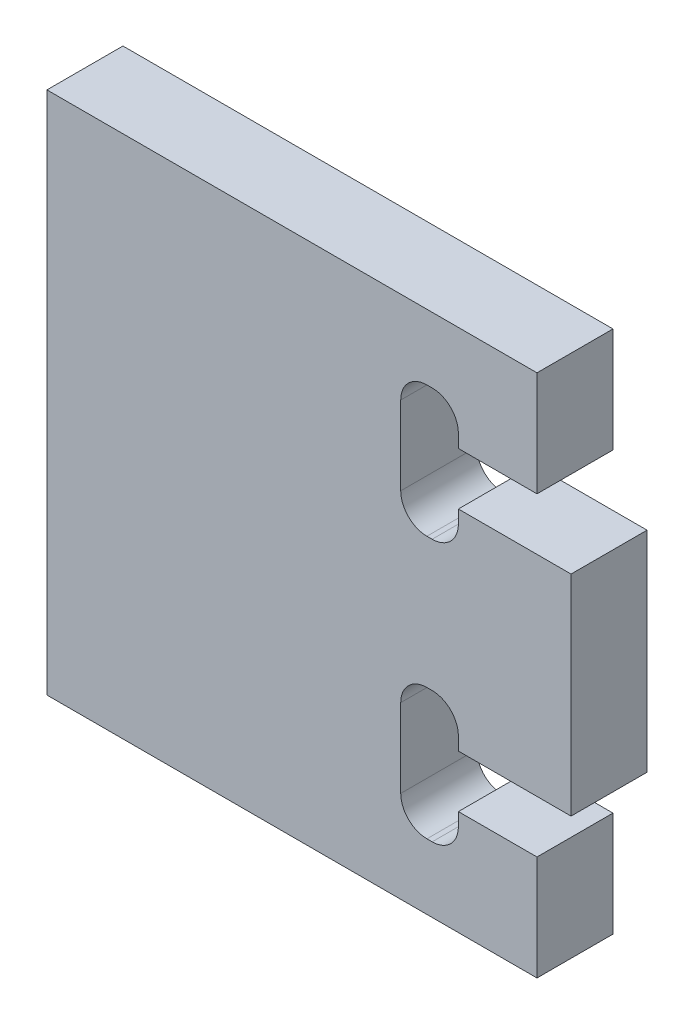
ISO-10303-21;
HEADER;
FILE_DESCRIPTION(('STEP AP214'),'2;1');
FILE_NAME('part.step','',(''),(''),'','','');
FILE_SCHEMA(('AUTOMOTIVE_DESIGN { 1 0 10303 214 1 1 1 1 }'));
ENDSEC;
DATA;
#1=APPLICATION_CONTEXT('core data for automotive mechanical design processes');
#2=APPLICATION_PROTOCOL_DEFINITION('international standard','automotive_design',2000,#1);
#3=PRODUCT_CONTEXT('',#1,'mechanical');
#4=PRODUCT('Part','Part','',(#3));
#5=PRODUCT_RELATED_PRODUCT_CATEGORY('part','',(#4));
#6=PRODUCT_DEFINITION_FORMATION('','',#4);
#7=PRODUCT_DEFINITION_CONTEXT('part definition',#1,'design');
#8=PRODUCT_DEFINITION('design','',#6,#7);
#9=PRODUCT_DEFINITION_SHAPE('','',#8);
#10=(LENGTH_UNIT() NAMED_UNIT(*) SI_UNIT(.MILLI.,.METRE.));
#11=(NAMED_UNIT(*) PLANE_ANGLE_UNIT() SI_UNIT($,.RADIAN.));
#12=(NAMED_UNIT(*) SI_UNIT($,.STERADIAN.) SOLID_ANGLE_UNIT());
#13=UNCERTAINTY_MEASURE_WITH_UNIT(LENGTH_MEASURE(1.E-05),#10,'distance_accuracy_value','');
#14=(GEOMETRIC_REPRESENTATION_CONTEXT(3) GLOBAL_UNCERTAINTY_ASSIGNED_CONTEXT((#13)) GLOBAL_UNIT_ASSIGNED_CONTEXT((#10,
#11,#12)) REPRESENTATION_CONTEXT('',''));
#15=CARTESIAN_POINT('',(0.,0.,0.));
#16=DIRECTION('',(0.,0.,1.));
#17=DIRECTION('',(1.,0.,0.));
#18=AXIS2_PLACEMENT_3D('',#15,#16,#17);
#19=CARTESIAN_POINT('',(36.5,0.,2.9));
#20=DIRECTION('',(-1.,0.,0.));
#21=DIRECTION('',(0.,-1.,0.));
#22=AXIS2_PLACEMENT_3D('',#19,#20,#21);
#23=PLANE('',#22);
#24=DIRECTION('',(0.,1.,0.));
#25=VECTOR('',#24,1.);
#26=CARTESIAN_POINT('',(36.5,0.,2.9));
#27=LINE('',#26,#25);
#28=CARTESIAN_POINT('',(36.5,-3.99999999999999,2.9));
#29=VERTEX_POINT('',#28);
#30=CARTESIAN_POINT('',(36.5,-3.5,2.9));
#31=VERTEX_POINT('',#30);
#32=EDGE_CURVE('E264',#29,#31,#27,.T.);
#33=ORIENTED_EDGE('',*,*,#32,.T.);
#34=DIRECTION('',(0.,0.,-1.));
#35=VECTOR('',#34,1.);
#36=CARTESIAN_POINT('',(36.5,-3.5,2.9));
#37=LINE('',#36,#35);
#38=CARTESIAN_POINT('',(36.5,-3.5,0.));
#39=VERTEX_POINT('',#38);
#40=EDGE_CURVE('E314',#31,#39,#37,.T.);
#41=ORIENTED_EDGE('',*,*,#40,.T.);
#42=DIRECTION('',(0.,1.,0.));
#43=VECTOR('',#42,1.);
#44=CARTESIAN_POINT('',(36.5,0.,0.));
#45=LINE('',#44,#43);
#46=CARTESIAN_POINT('',(36.5,-3.99999999999999,0.));
#47=VERTEX_POINT('',#46);
#48=EDGE_CURVE('E238',#47,#39,#45,.T.);
#49=ORIENTED_EDGE('',*,*,#48,.F.);
#50=DIRECTION('',(0.,0.,-1.));
#51=VECTOR('',#50,1.);
#52=CARTESIAN_POINT('',(36.5,-3.99999999999999,2.9));
#53=LINE('',#52,#51);
#54=EDGE_CURVE('E288',#29,#47,#53,.T.);
#55=ORIENTED_EDGE('',*,*,#54,.F.);
#56=EDGE_LOOP('',(#33,#41,#49,#55));
#57=FACE_BOUND('',#56,.T.);
#58=ADVANCED_FACE('F38',(#57),#23,.T.);
#59=CARTESIAN_POINT('',(0.,-4.,2.9));
#60=DIRECTION('',(0.,1.,0.));
#61=DIRECTION('',(-1.,0.,0.));
#62=AXIS2_PLACEMENT_3D('',#59,#60,#61);
#63=PLANE('',#62);
#64=DIRECTION('',(1.,0.,0.));
#65=VECTOR('',#64,1.);
#66=CARTESIAN_POINT('',(0.,-4.,0.));
#67=LINE('',#66,#65);
#68=CARTESIAN_POINT('',(40.8,-3.99999999999999,0.));
#69=VERTEX_POINT('',#68);
#70=EDGE_CURVE('E409',#47,#69,#67,.T.);
#71=ORIENTED_EDGE('',*,*,#70,.T.);
#72=DIRECTION('',(0.,0.,-1.));
#73=VECTOR('',#72,1.);
#74=CARTESIAN_POINT('',(40.8,-3.99999999999999,2.9));
#75=LINE('',#74,#73);
#76=CARTESIAN_POINT('',(40.8,-3.99999999999999,2.9));
#77=VERTEX_POINT('',#76);
#78=EDGE_CURVE('E285',#77,#69,#75,.T.);
#79=ORIENTED_EDGE('',*,*,#78,.F.);
#80=DIRECTION('',(1.,0.,0.));
#81=VECTOR('',#80,1.);
#82=CARTESIAN_POINT('',(0.,-4.,2.9));
#83=LINE('',#82,#81);
#84=EDGE_CURVE('E453',#29,#77,#83,.T.);
#85=ORIENTED_EDGE('',*,*,#84,.F.);
#86=ORIENTED_EDGE('',*,*,#54,.T.);
#87=EDGE_LOOP('',(#71,#79,#85,#86));
#88=FACE_BOUND('',#87,.T.);
#89=ADVANCED_FACE('F490',(#88),#63,.F.);
#90=CARTESIAN_POINT('',(40.8,0.,2.9));
#91=DIRECTION('',(-1.,0.,0.));
#92=DIRECTION('',(0.,0.,1.));
#93=AXIS2_PLACEMENT_3D('',#90,#91,#92);
#94=PLANE('',#93);
#95=DIRECTION('',(0.,1.,0.));
#96=VECTOR('',#95,1.);
#97=CARTESIAN_POINT('',(40.8,0.,0.));
#98=LINE('',#97,#96);
#99=CARTESIAN_POINT('',(40.8,3.99999999999999,0.));
#100=VERTEX_POINT('',#99);
#101=EDGE_CURVE('E411',#69,#100,#98,.T.);
#102=ORIENTED_EDGE('',*,*,#101,.T.);
#103=DIRECTION('',(0.,0.,-1.));
#104=VECTOR('',#103,1.);
#105=CARTESIAN_POINT('',(40.8,3.99999999999999,2.9));
#106=LINE('',#105,#104);
#107=CARTESIAN_POINT('',(40.8,3.99999999999999,2.9));
#108=VERTEX_POINT('',#107);
#109=EDGE_CURVE('E283',#108,#100,#106,.T.);
#110=ORIENTED_EDGE('',*,*,#109,.F.);
#111=DIRECTION('',(0.,1.,0.));
#112=VECTOR('',#111,1.);
#113=CARTESIAN_POINT('',(40.8,0.,2.9));
#114=LINE('',#113,#112);
#115=EDGE_CURVE('E455',#77,#108,#114,.T.);
#116=ORIENTED_EDGE('',*,*,#115,.F.);
#117=ORIENTED_EDGE('',*,*,#78,.T.);
#118=EDGE_LOOP('',(#102,#110,#116,#117));
#119=FACE_BOUND('',#118,.T.);
#120=ADVANCED_FACE('F485',(#119),#94,.F.);
#121=CARTESIAN_POINT('',(0.,4.,2.9));
#122=DIRECTION('',(0.,1.,0.));
#123=DIRECTION('',(-1.,0.,0.));
#124=AXIS2_PLACEMENT_3D('',#121,#122,#123);
#125=PLANE('',#124);
#126=DIRECTION('',(1.,0.,0.));
#127=VECTOR('',#126,1.);
#128=CARTESIAN_POINT('',(0.,4.,0.));
#129=LINE('',#128,#127);
#130=CARTESIAN_POINT('',(36.5,3.99999999999999,0.));
#131=VERTEX_POINT('',#130);
#132=EDGE_CURVE('E414',#131,#100,#129,.T.);
#133=ORIENTED_EDGE('',*,*,#132,.F.);
#134=DIRECTION('',(0.,0.,-1.));
#135=VECTOR('',#134,1.);
#136=CARTESIAN_POINT('',(36.5,3.99999999999999,2.9));
#137=LINE('',#136,#135);
#138=CARTESIAN_POINT('',(36.5,3.99999999999999,2.9));
#139=VERTEX_POINT('',#138);
#140=EDGE_CURVE('E281',#139,#131,#137,.T.);
#141=ORIENTED_EDGE('',*,*,#140,.F.);
#142=DIRECTION('',(1.,0.,0.));
#143=VECTOR('',#142,1.);
#144=CARTESIAN_POINT('',(0.,4.,2.9));
#145=LINE('',#144,#143);
#146=EDGE_CURVE('E457',#139,#108,#145,.T.);
#147=ORIENTED_EDGE('',*,*,#146,.T.);
#148=ORIENTED_EDGE('',*,*,#109,.T.);
#149=EDGE_LOOP('',(#133,#141,#147,#148));
#150=FACE_BOUND('',#149,.T.);
#151=ADVANCED_FACE('F479',(#150),#125,.T.);
#152=CARTESIAN_POINT('',(36.5,0.,2.9));
#153=DIRECTION('',(1.,0.,0.));
#154=DIRECTION('',(0.,1.,0.));
#155=AXIS2_PLACEMENT_3D('',#152,#153,#154);
#156=PLANE('',#155);
#157=DIRECTION('',(0.,-1.,0.));
#158=VECTOR('',#157,1.);
#159=CARTESIAN_POINT('',(36.5,0.,0.));
#160=LINE('',#159,#158);
#161=CARTESIAN_POINT('',(36.5,3.5,0.));
#162=VERTEX_POINT('',#161);
#163=EDGE_CURVE('E417',#131,#162,#160,.T.);
#164=ORIENTED_EDGE('',*,*,#163,.T.);
#165=DIRECTION('',(0.,0.,-1.));
#166=VECTOR('',#165,1.);
#167=CARTESIAN_POINT('',(36.5,3.5,2.9));
#168=LINE('',#167,#166);
#169=CARTESIAN_POINT('',(36.5,3.5,2.9));
#170=VERTEX_POINT('',#169);
#171=EDGE_CURVE('E302',#162,#170,#168,.F.);
#172=ORIENTED_EDGE('',*,*,#171,.T.);
#173=DIRECTION('',(0.,-1.,0.));
#174=VECTOR('',#173,1.);
#175=CARTESIAN_POINT('',(36.5,0.,2.9));
#176=LINE('',#175,#174);
#177=EDGE_CURVE('E382',#139,#170,#176,.T.);
#178=ORIENTED_EDGE('',*,*,#177,.F.);
#179=ORIENTED_EDGE('',*,*,#140,.T.);
#180=EDGE_LOOP('',(#164,#172,#178,#179));
#181=FACE_BOUND('',#180,.T.);
#182=ADVANCED_FACE('F475',(#181),#156,.F.);
#183=CARTESIAN_POINT('',(0.,2.50000000000001,2.9));
#184=DIRECTION('',(0.,1.,0.));
#185=DIRECTION('',(-1.,0.,0.));
#186=AXIS2_PLACEMENT_3D('',#183,#184,#185);
#187=PLANE('',#186);
#188=DIRECTION('',(1.,0.,0.));
#189=VECTOR('',#188,1.);
#190=CARTESIAN_POINT('',(0.,2.50000000000001,2.9));
#191=LINE('',#190,#189);
#192=CARTESIAN_POINT('',(35.3,2.5,2.9));
#193=VERTEX_POINT('',#192);
#194=CARTESIAN_POINT('',(35.5,2.5,2.9));
#195=VERTEX_POINT('',#194);
#196=EDGE_CURVE('E383',#193,#195,#191,.T.);
#197=ORIENTED_EDGE('',*,*,#196,.T.);
#198=DIRECTION('',(0.,0.,-1.));
#199=VECTOR('',#198,1.);
#200=CARTESIAN_POINT('',(35.5,2.5,2.9));
#201=LINE('',#200,#199);
#202=CARTESIAN_POINT('',(35.5,2.5,0.));
#203=VERTEX_POINT('',#202);
#204=EDGE_CURVE('E299',#195,#203,#201,.T.);
#205=ORIENTED_EDGE('',*,*,#204,.T.);
#206=DIRECTION('',(1.,0.,0.));
#207=VECTOR('',#206,1.);
#208=CARTESIAN_POINT('',(0.,2.50000000000001,0.));
#209=LINE('',#208,#207);
#210=CARTESIAN_POINT('',(35.3,2.5,0.));
#211=VERTEX_POINT('',#210);
#212=EDGE_CURVE('E369',#211,#203,#209,.T.);
#213=ORIENTED_EDGE('',*,*,#212,.F.);
#214=DIRECTION('',(0.,0.,-1.));
#215=VECTOR('',#214,1.);
#216=CARTESIAN_POINT('',(35.3,2.5,2.9));
#217=LINE('',#216,#215);
#218=EDGE_CURVE('E297',#211,#193,#217,.F.);
#219=ORIENTED_EDGE('',*,*,#218,.T.);
#220=EDGE_LOOP('',(#197,#205,#213,#219));
#221=FACE_BOUND('',#220,.T.);
#222=ADVANCED_FACE('F464',(#221),#187,.T.);
#223=CARTESIAN_POINT('',(34.3,0.,2.9));
#224=DIRECTION('',(1.,0.,0.));
#225=DIRECTION('',(0.,1.,0.));
#226=AXIS2_PLACEMENT_3D('',#223,#224,#225);
#227=PLANE('',#226);
#228=DIRECTION('',(0.,-1.,0.));
#229=VECTOR('',#228,1.);
#230=CARTESIAN_POINT('',(34.3,0.,2.9));
#231=LINE('',#230,#229);
#232=CARTESIAN_POINT('',(34.3,6.5,2.9));
#233=VERTEX_POINT('',#232);
#234=CARTESIAN_POINT('',(34.3,3.5,2.9));
#235=VERTEX_POINT('',#234);
#236=EDGE_CURVE('E376',#233,#235,#231,.T.);
#237=ORIENTED_EDGE('',*,*,#236,.T.);
#238=DIRECTION('',(0.,0.,-1.));
#239=VECTOR('',#238,1.);
#240=CARTESIAN_POINT('',(34.3,3.5,0.));
#241=LINE('',#240,#239);
#242=CARTESIAN_POINT('',(34.3,3.5,0.));
#243=VERTEX_POINT('',#242);
#244=EDGE_CURVE('E306',#235,#243,#241,.T.);
#245=ORIENTED_EDGE('',*,*,#244,.T.);
#246=DIRECTION('',(0.,-1.,0.));
#247=VECTOR('',#246,1.);
#248=CARTESIAN_POINT('',(34.3,0.,0.));
#249=LINE('',#248,#247);
#250=CARTESIAN_POINT('',(34.3,6.5,0.));
#251=VERTEX_POINT('',#250);
#252=EDGE_CURVE('E359',#251,#243,#249,.T.);
#253=ORIENTED_EDGE('',*,*,#252,.F.);
#254=DIRECTION('',(0.,0.,-1.));
#255=VECTOR('',#254,1.);
#256=CARTESIAN_POINT('',(34.3,6.5,2.9));
#257=LINE('',#256,#255);
#258=EDGE_CURVE('E304',#251,#233,#257,.F.);
#259=ORIENTED_EDGE('',*,*,#258,.T.);
#260=EDGE_LOOP('',(#237,#245,#253,#259));
#261=FACE_BOUND('',#260,.T.);
#262=ADVANCED_FACE('F366',(#261),#227,.T.);
#263=CARTESIAN_POINT('',(0.,7.5,2.9));
#264=DIRECTION('',(0.,1.,0.));
#265=DIRECTION('',(0.,0.,1.));
#266=AXIS2_PLACEMENT_3D('',#263,#264,#265);
#267=PLANE('',#266);
#268=DIRECTION('',(1.,0.,0.));
#269=VECTOR('',#268,1.);
#270=CARTESIAN_POINT('',(0.,7.5,0.));
#271=LINE('',#270,#269);
#272=CARTESIAN_POINT('',(35.3,7.5,0.));
#273=VERTEX_POINT('',#272);
#274=CARTESIAN_POINT('',(35.5,7.5,0.));
#275=VERTEX_POINT('',#274);
#276=EDGE_CURVE('E360',#273,#275,#271,.T.);
#277=ORIENTED_EDGE('',*,*,#276,.T.);
#278=DIRECTION('',(0.,0.,-1.));
#279=VECTOR('',#278,1.);
#280=CARTESIAN_POINT('',(35.5,7.5,2.9));
#281=LINE('',#280,#279);
#282=CARTESIAN_POINT('',(35.5,7.5,2.9));
#283=VERTEX_POINT('',#282);
#284=EDGE_CURVE('E61',#275,#283,#281,.F.);
#285=ORIENTED_EDGE('',*,*,#284,.T.);
#286=DIRECTION('',(1.,0.,0.));
#287=VECTOR('',#286,1.);
#288=CARTESIAN_POINT('',(0.,7.5,2.9));
#289=LINE('',#288,#287);
#290=CARTESIAN_POINT('',(35.3,7.5,2.9));
#291=VERTEX_POINT('',#290);
#292=EDGE_CURVE('E374',#291,#283,#289,.T.);
#293=ORIENTED_EDGE('',*,*,#292,.F.);
#294=DIRECTION('',(0.,0.,-1.));
#295=VECTOR('',#294,1.);
#296=CARTESIAN_POINT('',(35.3,7.5,2.9));
#297=LINE('',#296,#295);
#298=EDGE_CURVE('E325',#291,#273,#297,.T.);
#299=ORIENTED_EDGE('',*,*,#298,.T.);
#300=EDGE_LOOP('',(#277,#285,#293,#299));
#301=FACE_BOUND('',#300,.T.);
#302=ADVANCED_FACE('F377',(#301),#267,.F.);
#303=CARTESIAN_POINT('',(36.5,6.5,2.9));
#304=VERTEX_POINT('',#303);
#305=CARTESIAN_POINT('',(36.5,5.99999999999999,2.9));
#306=VERTEX_POINT('',#305);
#307=EDGE_CURVE('E378',#304,#306,#176,.T.);
#308=ORIENTED_EDGE('',*,*,#307,.F.);
#309=DIRECTION('',(0.,0.,-1.));
#310=VECTOR('',#309,1.);
#311=CARTESIAN_POINT('',(36.5,6.5,0.));
#312=LINE('',#311,#310);
#313=CARTESIAN_POINT('',(36.5,6.5,0.));
#314=VERTEX_POINT('',#313);
#315=EDGE_CURVE('E322',#304,#314,#312,.T.);
#316=ORIENTED_EDGE('',*,*,#315,.T.);
#317=CARTESIAN_POINT('',(36.5,5.99999999999999,0.));
#318=VERTEX_POINT('',#317);
#319=EDGE_CURVE('E420',#314,#318,#160,.T.);
#320=ORIENTED_EDGE('',*,*,#319,.T.);
#321=DIRECTION('',(0.,0.,-1.));
#322=VECTOR('',#321,1.);
#323=CARTESIAN_POINT('',(36.5,5.99999999999999,2.9));
#324=LINE('',#323,#322);
#325=EDGE_CURVE('E278',#306,#318,#324,.T.);
#326=ORIENTED_EDGE('',*,*,#325,.F.);
#327=EDGE_LOOP('',(#308,#316,#320,#326));
#328=FACE_BOUND('',#327,.T.);
#329=ADVANCED_FACE('F441',(#328),#156,.F.);
#330=CARTESIAN_POINT('',(0.,6.,2.9));
#331=DIRECTION('',(0.,1.,0.));
#332=DIRECTION('',(-1.,0.,0.));
#333=AXIS2_PLACEMENT_3D('',#330,#331,#332);
#334=PLANE('',#333);
#335=DIRECTION('',(1.,0.,0.));
#336=VECTOR('',#335,1.);
#337=CARTESIAN_POINT('',(0.,6.,0.));
#338=LINE('',#337,#336);
#339=CARTESIAN_POINT('',(39.5,5.99999999999999,0.));
#340=VERTEX_POINT('',#339);
#341=EDGE_CURVE('E424',#318,#340,#338,.T.);
#342=ORIENTED_EDGE('',*,*,#341,.T.);
#343=DIRECTION('',(0.,0.,-1.));
#344=VECTOR('',#343,1.);
#345=CARTESIAN_POINT('',(39.5,5.99999999999999,2.9));
#346=LINE('',#345,#344);
#347=CARTESIAN_POINT('',(39.5,5.99999999999999,2.9));
#348=VERTEX_POINT('',#347);
#349=EDGE_CURVE('E276',#348,#340,#346,.T.);
#350=ORIENTED_EDGE('',*,*,#349,.F.);
#351=DIRECTION('',(1.,0.,0.));
#352=VECTOR('',#351,1.);
#353=CARTESIAN_POINT('',(0.,6.,2.9));
#354=LINE('',#353,#352);
#355=EDGE_CURVE('E380',#306,#348,#354,.T.);
#356=ORIENTED_EDGE('',*,*,#355,.F.);
#357=ORIENTED_EDGE('',*,*,#325,.T.);
#358=EDGE_LOOP('',(#342,#350,#356,#357));
#359=FACE_BOUND('',#358,.T.);
#360=ADVANCED_FACE('F437',(#359),#334,.F.);
#361=CARTESIAN_POINT('',(39.5,0.,2.9));
#362=DIRECTION('',(1.,0.,0.));
#363=DIRECTION('',(0.,0.,-1.));
#364=AXIS2_PLACEMENT_3D('',#361,#362,#363);
#365=PLANE('',#364);
#366=DIRECTION('',(0.,-1.,0.));
#367=VECTOR('',#366,1.);
#368=CARTESIAN_POINT('',(39.5,0.,0.));
#369=LINE('',#368,#367);
#370=CARTESIAN_POINT('',(39.5,10.,0.));
#371=VERTEX_POINT('',#370);
#372=EDGE_CURVE('E249',#371,#340,#369,.T.);
#373=ORIENTED_EDGE('',*,*,#372,.F.);
#374=DIRECTION('',(0.,0.,-1.));
#375=VECTOR('',#374,1.);
#376=CARTESIAN_POINT('',(39.5,10.,2.9));
#377=LINE('',#376,#375);
#378=CARTESIAN_POINT('',(39.5,10.,2.9));
#379=VERTEX_POINT('',#378);
#380=EDGE_CURVE('E273',#379,#371,#377,.T.);
#381=ORIENTED_EDGE('',*,*,#380,.F.);
#382=DIRECTION('',(0.,-1.,0.));
#383=VECTOR('',#382,1.);
#384=CARTESIAN_POINT('',(39.5,0.,2.9));
#385=LINE('',#384,#383);
#386=EDGE_CURVE('E388',#379,#348,#385,.T.);
#387=ORIENTED_EDGE('',*,*,#386,.T.);
#388=ORIENTED_EDGE('',*,*,#349,.T.);
#389=EDGE_LOOP('',(#373,#381,#387,#388));
#390=FACE_BOUND('',#389,.T.);
#391=ADVANCED_FACE('F432',(#390),#365,.T.);
#392=CARTESIAN_POINT('',(0.,10.,2.9));
#393=DIRECTION('',(0.,1.,0.));
#394=DIRECTION('',(0.,0.,1.));
#395=AXIS2_PLACEMENT_3D('',#392,#393,#394);
#396=PLANE('',#395);
#397=DIRECTION('',(0.,0.,1.));
#398=VECTOR('',#397,1.);
#399=CARTESIAN_POINT('',(20.8,10.,-0.00100000000000013));
#400=LINE('',#399,#398);
#401=CARTESIAN_POINT('',(20.8,10.,0.));
#402=VERTEX_POINT('',#401);
#403=CARTESIAN_POINT('',(20.8,10.,2.9));
#404=VERTEX_POINT('',#403);
#405=EDGE_CURVE('E53',#402,#404,#400,.T.);
#406=ORIENTED_EDGE('',*,*,#405,.T.);
#407=DIRECTION('',(1.,0.,0.));
#408=VECTOR('',#407,1.);
#409=CARTESIAN_POINT('',(0.,10.,2.9));
#410=LINE('',#409,#408);
#411=EDGE_CURVE('E391',#404,#379,#410,.T.);
#412=ORIENTED_EDGE('',*,*,#411,.T.);
#413=ORIENTED_EDGE('',*,*,#380,.T.);
#414=DIRECTION('',(1.,0.,0.));
#415=VECTOR('',#414,1.);
#416=CARTESIAN_POINT('',(0.,10.,0.));
#417=LINE('',#416,#415);
#418=EDGE_CURVE('E245',#402,#371,#417,.T.);
#419=ORIENTED_EDGE('',*,*,#418,.F.);
#420=EDGE_LOOP('',(#406,#412,#413,#419));
#421=FACE_BOUND('',#420,.T.);
#422=ADVANCED_FACE('F447',(#421),#396,.T.);
#423=CARTESIAN_POINT('',(0.,-10.,2.9));
#424=DIRECTION('',(0.,1.,0.));
#425=DIRECTION('',(0.,0.,1.));
#426=AXIS2_PLACEMENT_3D('',#423,#424,#425);
#427=PLANE('',#426);
#428=DIRECTION('',(1.,0.,0.));
#429=VECTOR('',#428,1.);
#430=CARTESIAN_POINT('',(0.,-10.,2.9));
#431=LINE('',#430,#429);
#432=CARTESIAN_POINT('',(20.8,-10.,2.9));
#433=VERTEX_POINT('',#432);
#434=CARTESIAN_POINT('',(39.5,-10.,2.9));
#435=VERTEX_POINT('',#434);
#436=EDGE_CURVE('E237',#433,#435,#431,.T.);
#437=ORIENTED_EDGE('',*,*,#436,.F.);
#438=DIRECTION('',(0.,0.,1.));
#439=VECTOR('',#438,1.);
#440=CARTESIAN_POINT('',(20.8,-10.,-0.00100000000000013));
#441=LINE('',#440,#439);
#442=CARTESIAN_POINT('',(20.8,-10.,0.));
#443=VERTEX_POINT('',#442);
#444=EDGE_CURVE('E224',#443,#433,#441,.T.);
#445=ORIENTED_EDGE('',*,*,#444,.F.);
#446=DIRECTION('',(1.,0.,0.));
#447=VECTOR('',#446,1.);
#448=CARTESIAN_POINT('',(0.,-10.,0.));
#449=LINE('',#448,#447);
#450=CARTESIAN_POINT('',(39.5,-10.,0.));
#451=VERTEX_POINT('',#450);
#452=EDGE_CURVE('E235',#443,#451,#449,.T.);
#453=ORIENTED_EDGE('',*,*,#452,.T.);
#454=DIRECTION('',(0.,0.,-1.));
#455=VECTOR('',#454,1.);
#456=CARTESIAN_POINT('',(39.5,-10.,2.9));
#457=LINE('',#456,#455);
#458=EDGE_CURVE('E271',#435,#451,#457,.T.);
#459=ORIENTED_EDGE('',*,*,#458,.F.);
#460=EDGE_LOOP('',(#437,#445,#453,#459));
#461=FACE_BOUND('',#460,.T.);
#462=ADVANCED_FACE('F233',(#461),#427,.F.);
#463=CARTESIAN_POINT('',(39.5,-5.99999999999999,0.));
#464=VERTEX_POINT('',#463);
#465=EDGE_CURVE('E244',#464,#451,#369,.T.);
#466=ORIENTED_EDGE('',*,*,#465,.F.);
#467=DIRECTION('',(0.,0.,-1.));
#468=VECTOR('',#467,1.);
#469=CARTESIAN_POINT('',(39.5,-5.99999999999999,2.9));
#470=LINE('',#469,#468);
#471=CARTESIAN_POINT('',(39.5,-5.99999999999999,2.9));
#472=VERTEX_POINT('',#471);
#473=EDGE_CURVE('E268',#472,#464,#470,.T.);
#474=ORIENTED_EDGE('',*,*,#473,.F.);
#475=EDGE_CURVE('E392',#472,#435,#385,.T.);
#476=ORIENTED_EDGE('',*,*,#475,.T.);
#477=ORIENTED_EDGE('',*,*,#458,.T.);
#478=EDGE_LOOP('',(#466,#474,#476,#477));
#479=FACE_BOUND('',#478,.T.);
#480=ADVANCED_FACE('F537',(#479),#365,.T.);
#481=CARTESIAN_POINT('',(0.,-6.,2.9));
#482=DIRECTION('',(0.,1.,0.));
#483=DIRECTION('',(-1.,0.,0.));
#484=AXIS2_PLACEMENT_3D('',#481,#482,#483);
#485=PLANE('',#484);
#486=DIRECTION('',(1.,0.,0.));
#487=VECTOR('',#486,1.);
#488=CARTESIAN_POINT('',(0.,-6.,0.));
#489=LINE('',#488,#487);
#490=CARTESIAN_POINT('',(36.5,-5.99999999999999,0.));
#491=VERTEX_POINT('',#490);
#492=EDGE_CURVE('E247',#491,#464,#489,.T.);
#493=ORIENTED_EDGE('',*,*,#492,.F.);
#494=DIRECTION('',(0.,0.,-1.));
#495=VECTOR('',#494,1.);
#496=CARTESIAN_POINT('',(36.5,-5.99999999999999,2.9));
#497=LINE('',#496,#495);
#498=CARTESIAN_POINT('',(36.5,-5.99999999999999,2.9));
#499=VERTEX_POINT('',#498);
#500=EDGE_CURVE('E265',#499,#491,#497,.T.);
#501=ORIENTED_EDGE('',*,*,#500,.F.);
#502=DIRECTION('',(1.,0.,0.));
#503=VECTOR('',#502,1.);
#504=CARTESIAN_POINT('',(0.,-6.,2.9));
#505=LINE('',#504,#503);
#506=EDGE_CURVE('E395',#499,#472,#505,.T.);
#507=ORIENTED_EDGE('',*,*,#506,.T.);
#508=ORIENTED_EDGE('',*,*,#473,.T.);
#509=EDGE_LOOP('',(#493,#501,#507,#508));
#510=FACE_BOUND('',#509,.T.);
#511=ADVANCED_FACE('F533',(#510),#485,.T.);
#512=CARTESIAN_POINT('',(36.5,-6.5,0.));
#513=VERTEX_POINT('',#512);
#514=EDGE_CURVE('E254',#513,#491,#45,.T.);
#515=ORIENTED_EDGE('',*,*,#514,.F.);
#516=DIRECTION('',(0.,0.,-1.));
#517=VECTOR('',#516,1.);
#518=CARTESIAN_POINT('',(36.5,-6.5,2.9));
#519=LINE('',#518,#517);
#520=CARTESIAN_POINT('',(36.5,-6.5,2.9));
#521=VERTEX_POINT('',#520);
#522=EDGE_CURVE('E295',#513,#521,#519,.F.);
#523=ORIENTED_EDGE('',*,*,#522,.T.);
#524=EDGE_CURVE('E398',#521,#499,#27,.T.);
#525=ORIENTED_EDGE('',*,*,#524,.T.);
#526=ORIENTED_EDGE('',*,*,#500,.T.);
#527=EDGE_LOOP('',(#515,#523,#525,#526));
#528=FACE_BOUND('',#527,.T.);
#529=ADVANCED_FACE('F527',(#528),#23,.T.);
#530=CARTESIAN_POINT('',(0.,-7.5,2.9));
#531=DIRECTION('',(0.,1.,0.));
#532=DIRECTION('',(0.,0.,1.));
#533=AXIS2_PLACEMENT_3D('',#530,#531,#532);
#534=PLANE('',#533);
#535=DIRECTION('',(1.,0.,0.));
#536=VECTOR('',#535,1.);
#537=CARTESIAN_POINT('',(0.,-7.5,2.9));
#538=LINE('',#537,#536);
#539=CARTESIAN_POINT('',(35.3,-7.5,2.9));
#540=VERTEX_POINT('',#539);
#541=CARTESIAN_POINT('',(35.5,-7.5,2.9));
#542=VERTEX_POINT('',#541);
#543=EDGE_CURVE('E399',#540,#542,#538,.T.);
#544=ORIENTED_EDGE('',*,*,#543,.T.);
#545=DIRECTION('',(0.,0.,-1.));
#546=VECTOR('',#545,1.);
#547=CARTESIAN_POINT('',(35.5,-7.5,0.));
#548=LINE('',#547,#546);
#549=CARTESIAN_POINT('',(35.5,-7.5,0.));
#550=VERTEX_POINT('',#549);
#551=EDGE_CURVE('E292',#542,#550,#548,.T.);
#552=ORIENTED_EDGE('',*,*,#551,.T.);
#553=DIRECTION('',(1.,0.,0.));
#554=VECTOR('',#553,1.);
#555=CARTESIAN_POINT('',(0.,-7.5,0.));
#556=LINE('',#555,#554);
#557=CARTESIAN_POINT('',(35.3,-7.5,0.));
#558=VERTEX_POINT('',#557);
#559=EDGE_CURVE('E255',#558,#550,#556,.T.);
#560=ORIENTED_EDGE('',*,*,#559,.F.);
#561=DIRECTION('',(0.,0.,-1.));
#562=VECTOR('',#561,1.);
#563=CARTESIAN_POINT('',(35.3,-7.5,2.9));
#564=LINE('',#563,#562);
#565=EDGE_CURVE('E290',#558,#540,#564,.F.);
#566=ORIENTED_EDGE('',*,*,#565,.T.);
#567=EDGE_LOOP('',(#544,#552,#560,#566));
#568=FACE_BOUND('',#567,.T.);
#569=ADVANCED_FACE('F518',(#568),#534,.T.);
#570=CARTESIAN_POINT('',(34.3,0.,2.9));
#571=DIRECTION('',(-1.,0.,0.));
#572=DIRECTION('',(0.,-1.,0.));
#573=AXIS2_PLACEMENT_3D('',#570,#571,#572);
#574=PLANE('',#573);
#575=DIRECTION('',(0.,1.,0.));
#576=VECTOR('',#575,1.);
#577=CARTESIAN_POINT('',(34.3,0.,2.9));
#578=LINE('',#577,#576);
#579=CARTESIAN_POINT('',(34.3,-6.5,2.9));
#580=VERTEX_POINT('',#579);
#581=CARTESIAN_POINT('',(34.3,-3.5,2.9));
#582=VERTEX_POINT('',#581);
#583=EDGE_CURVE('E402',#580,#582,#578,.T.);
#584=ORIENTED_EDGE('',*,*,#583,.F.);
#585=DIRECTION('',(0.,0.,-1.));
#586=VECTOR('',#585,1.);
#587=CARTESIAN_POINT('',(34.3,-6.5,2.9));
#588=LINE('',#587,#586);
#589=CARTESIAN_POINT('',(34.3,-6.5,0.));
#590=VERTEX_POINT('',#589);
#591=EDGE_CURVE('E311',#580,#590,#588,.T.);
#592=ORIENTED_EDGE('',*,*,#591,.T.);
#593=DIRECTION('',(0.,1.,0.));
#594=VECTOR('',#593,1.);
#595=CARTESIAN_POINT('',(34.3,0.,0.));
#596=LINE('',#595,#594);
#597=CARTESIAN_POINT('',(34.3,-3.5,0.));
#598=VERTEX_POINT('',#597);
#599=EDGE_CURVE('E258',#590,#598,#596,.T.);
#600=ORIENTED_EDGE('',*,*,#599,.T.);
#601=DIRECTION('',(0.,0.,-1.));
#602=VECTOR('',#601,1.);
#603=CARTESIAN_POINT('',(34.3,-3.5,2.9));
#604=LINE('',#603,#602);
#605=EDGE_CURVE('E309',#598,#582,#604,.F.);
#606=ORIENTED_EDGE('',*,*,#605,.T.);
#607=EDGE_LOOP('',(#584,#592,#600,#606));
#608=FACE_BOUND('',#607,.T.);
#609=ADVANCED_FACE('F510',(#608),#574,.F.);
#610=CARTESIAN_POINT('',(0.,-2.50000000000001,2.9));
#611=DIRECTION('',(0.,1.,0.));
#612=DIRECTION('',(-1.,0.,0.));
#613=AXIS2_PLACEMENT_3D('',#610,#611,#612);
#614=PLANE('',#613);
#615=DIRECTION('',(1.,0.,0.));
#616=VECTOR('',#615,1.);
#617=CARTESIAN_POINT('',(0.,-2.50000000000001,0.));
#618=LINE('',#617,#616);
#619=CARTESIAN_POINT('',(35.3,-2.5,0.));
#620=VERTEX_POINT('',#619);
#621=CARTESIAN_POINT('',(35.5,-2.5,0.));
#622=VERTEX_POINT('',#621);
#623=EDGE_CURVE('E261',#620,#622,#618,.T.);
#624=ORIENTED_EDGE('',*,*,#623,.T.);
#625=DIRECTION('',(0.,0.,-1.));
#626=VECTOR('',#625,1.);
#627=CARTESIAN_POINT('',(35.5,-2.5,2.9));
#628=LINE('',#627,#626);
#629=CARTESIAN_POINT('',(35.5,-2.5,2.9));
#630=VERTEX_POINT('',#629);
#631=EDGE_CURVE('E320',#622,#630,#628,.F.);
#632=ORIENTED_EDGE('',*,*,#631,.T.);
#633=DIRECTION('',(1.,0.,0.));
#634=VECTOR('',#633,1.);
#635=CARTESIAN_POINT('',(0.,-2.50000000000001,2.9));
#636=LINE('',#635,#634);
#637=CARTESIAN_POINT('',(35.3,-2.5,2.9));
#638=VERTEX_POINT('',#637);
#639=EDGE_CURVE('E269',#638,#630,#636,.T.);
#640=ORIENTED_EDGE('',*,*,#639,.F.);
#641=DIRECTION('',(0.,0.,-1.));
#642=VECTOR('',#641,1.);
#643=CARTESIAN_POINT('',(35.3,-2.5,0.));
#644=LINE('',#643,#642);
#645=EDGE_CURVE('E317',#638,#620,#644,.T.);
#646=ORIENTED_EDGE('',*,*,#645,.T.);
#647=EDGE_LOOP('',(#624,#632,#640,#646));
#648=FACE_BOUND('',#647,.T.);
#649=ADVANCED_FACE('F498',(#648),#614,.F.);
#650=CARTESIAN_POINT('',(0.,0.,2.9));
#651=DIRECTION('',(0.,0.,1.));
#652=DIRECTION('',(1.,0.,0.));
#653=AXIS2_PLACEMENT_3D('',#650,#651,#652);
#654=PLANE('',#653);
#655=DIRECTION('',(0.,1.,0.));
#656=VECTOR('',#655,1.);
#657=CARTESIAN_POINT('',(20.8,10.,2.9));
#658=LINE('',#657,#656);
#659=EDGE_CURVE('E229',#433,#404,#658,.T.);
#660=ORIENTED_EDGE('',*,*,#659,.F.);
#661=ORIENTED_EDGE('',*,*,#436,.T.);
#662=ORIENTED_EDGE('',*,*,#475,.F.);
#663=ORIENTED_EDGE('',*,*,#506,.F.);
#664=ORIENTED_EDGE('',*,*,#524,.F.);
#665=CARTESIAN_POINT('',(35.5,-6.5,2.9));
#666=DIRECTION('',(0.,0.,1.));
#667=DIRECTION('',(1.,0.,0.));
#668=AXIS2_PLACEMENT_3D('',#665,#666,#667);
#669=CIRCLE('',#668,1.);
#670=EDGE_CURVE('E331',#521,#542,#669,.F.);
#671=ORIENTED_EDGE('',*,*,#670,.T.);
#672=ORIENTED_EDGE('',*,*,#543,.F.);
#673=CARTESIAN_POINT('',(35.3,-6.5,2.9));
#674=DIRECTION('',(0.,0.,1.));
#675=DIRECTION('',(1.,0.,0.));
#676=AXIS2_PLACEMENT_3D('',#673,#674,#675);
#677=CIRCLE('',#676,1.);
#678=EDGE_CURVE('E343',#540,#580,#677,.F.);
#679=ORIENTED_EDGE('',*,*,#678,.T.);
#680=ORIENTED_EDGE('',*,*,#583,.T.);
#681=CARTESIAN_POINT('',(35.3,-3.5,2.9));
#682=DIRECTION('',(0.,0.,1.));
#683=DIRECTION('',(1.,0.,0.));
#684=AXIS2_PLACEMENT_3D('',#681,#682,#683);
#685=CIRCLE('',#684,1.);
#686=EDGE_CURVE('E355',#582,#638,#685,.F.);
#687=ORIENTED_EDGE('',*,*,#686,.T.);
#688=ORIENTED_EDGE('',*,*,#639,.T.);
#689=CARTESIAN_POINT('',(35.5,-3.5,2.9));
#690=DIRECTION('',(0.,0.,1.));
#691=DIRECTION('',(1.,0.,0.));
#692=AXIS2_PLACEMENT_3D('',#689,#690,#691);
#693=CIRCLE('',#692,1.);
#694=EDGE_CURVE('E347',#630,#31,#693,.F.);
#695=ORIENTED_EDGE('',*,*,#694,.T.);
#696=ORIENTED_EDGE('',*,*,#32,.F.);
#697=ORIENTED_EDGE('',*,*,#84,.T.);
#698=ORIENTED_EDGE('',*,*,#115,.T.);
#699=ORIENTED_EDGE('',*,*,#146,.F.);
#700=ORIENTED_EDGE('',*,*,#177,.T.);
#701=CARTESIAN_POINT('',(35.5,3.5,2.9));
#702=DIRECTION('',(0.,0.,1.));
#703=DIRECTION('',(1.,0.,0.));
#704=AXIS2_PLACEMENT_3D('',#701,#702,#703);
#705=CIRCLE('',#704,1.);
#706=EDGE_CURVE('E335',#170,#195,#705,.F.);
#707=ORIENTED_EDGE('',*,*,#706,.T.);
#708=ORIENTED_EDGE('',*,*,#196,.F.);
#709=CARTESIAN_POINT('',(35.3,3.5,2.9));
#710=DIRECTION('',(0.,0.,1.));
#711=DIRECTION('',(1.,0.,0.));
#712=AXIS2_PLACEMENT_3D('',#709,#710,#711);
#713=CIRCLE('',#712,1.);
#714=EDGE_CURVE('E339',#193,#235,#713,.F.);
#715=ORIENTED_EDGE('',*,*,#714,.T.);
#716=ORIENTED_EDGE('',*,*,#236,.F.);
#717=CARTESIAN_POINT('',(35.3,6.5,2.9));
#718=DIRECTION('',(0.,0.,1.));
#719=DIRECTION('',(1.,0.,0.));
#720=AXIS2_PLACEMENT_3D('',#717,#718,#719);
#721=CIRCLE('',#720,1.);
#722=EDGE_CURVE('E11',#233,#291,#721,.F.);
#723=ORIENTED_EDGE('',*,*,#722,.T.);
#724=ORIENTED_EDGE('',*,*,#292,.T.);
#725=CARTESIAN_POINT('',(35.5,6.5,2.9));
#726=DIRECTION('',(0.,0.,1.));
#727=DIRECTION('',(1.,0.,0.));
#728=AXIS2_PLACEMENT_3D('',#725,#726,#727);
#729=CIRCLE('',#728,1.);
#730=EDGE_CURVE('E351',#283,#304,#729,.F.);
#731=ORIENTED_EDGE('',*,*,#730,.T.);
#732=ORIENTED_EDGE('',*,*,#307,.T.);
#733=ORIENTED_EDGE('',*,*,#355,.T.);
#734=ORIENTED_EDGE('',*,*,#386,.F.);
#735=ORIENTED_EDGE('',*,*,#411,.F.);
#736=EDGE_LOOP('',(#660,#661,#662,#663,#664,#671,#672,#679,#680,#687,#688,#695,#696,#697,#698,
#699,#700,#707,#708,#715,#716,#723,#724,#731,#732,#733,#734,#735));
#737=FACE_BOUND('',#736,.T.);
#738=ADVANCED_FACE('F373',(#737),#654,.T.);
#739=CARTESIAN_POINT('',(0.,0.,0.));
#740=DIRECTION('',(0.,0.,1.));
#741=DIRECTION('',(1.,0.,0.));
#742=AXIS2_PLACEMENT_3D('',#739,#740,#741);
#743=PLANE('',#742);
#744=ORIENTED_EDGE('',*,*,#452,.F.);
#745=DIRECTION('',(0.,-1.,0.));
#746=VECTOR('',#745,1.);
#747=CARTESIAN_POINT('',(20.8,10.,0.));
#748=LINE('',#747,#746);
#749=EDGE_CURVE('E221',#402,#443,#748,.T.);
#750=ORIENTED_EDGE('',*,*,#749,.F.);
#751=ORIENTED_EDGE('',*,*,#418,.T.);
#752=ORIENTED_EDGE('',*,*,#372,.T.);
#753=ORIENTED_EDGE('',*,*,#341,.F.);
#754=ORIENTED_EDGE('',*,*,#319,.F.);
#755=CARTESIAN_POINT('',(35.5,6.5,0.));
#756=DIRECTION('',(0.,0.,1.));
#757=DIRECTION('',(1.,0.,0.));
#758=AXIS2_PLACEMENT_3D('',#755,#756,#757);
#759=CIRCLE('',#758,1.);
#760=EDGE_CURVE('E349',#314,#275,#759,.T.);
#761=ORIENTED_EDGE('',*,*,#760,.T.);
#762=ORIENTED_EDGE('',*,*,#276,.F.);
#763=CARTESIAN_POINT('',(35.3,6.5,0.));
#764=DIRECTION('',(0.,0.,1.));
#765=DIRECTION('',(1.,0.,0.));
#766=AXIS2_PLACEMENT_3D('',#763,#764,#765);
#767=CIRCLE('',#766,1.);
#768=EDGE_CURVE('E46',#273,#251,#767,.T.);
#769=ORIENTED_EDGE('',*,*,#768,.T.);
#770=ORIENTED_EDGE('',*,*,#252,.T.);
#771=CARTESIAN_POINT('',(35.3,3.5,0.));
#772=DIRECTION('',(0.,0.,1.));
#773=DIRECTION('',(1.,0.,0.));
#774=AXIS2_PLACEMENT_3D('',#771,#772,#773);
#775=CIRCLE('',#774,1.);
#776=EDGE_CURVE('E337',#243,#211,#775,.T.);
#777=ORIENTED_EDGE('',*,*,#776,.T.);
#778=ORIENTED_EDGE('',*,*,#212,.T.);
#779=CARTESIAN_POINT('',(35.5,3.5,0.));
#780=DIRECTION('',(0.,0.,1.));
#781=DIRECTION('',(1.,0.,0.));
#782=AXIS2_PLACEMENT_3D('',#779,#780,#781);
#783=CIRCLE('',#782,1.);
#784=EDGE_CURVE('E333',#203,#162,#783,.T.);
#785=ORIENTED_EDGE('',*,*,#784,.T.);
#786=ORIENTED_EDGE('',*,*,#163,.F.);
#787=ORIENTED_EDGE('',*,*,#132,.T.);
#788=ORIENTED_EDGE('',*,*,#101,.F.);
#789=ORIENTED_EDGE('',*,*,#70,.F.);
#790=ORIENTED_EDGE('',*,*,#48,.T.);
#791=CARTESIAN_POINT('',(35.5,-3.5,0.));
#792=DIRECTION('',(0.,0.,1.));
#793=DIRECTION('',(1.,0.,0.));
#794=AXIS2_PLACEMENT_3D('',#791,#792,#793);
#795=CIRCLE('',#794,1.);
#796=EDGE_CURVE('E345',#39,#622,#795,.T.);
#797=ORIENTED_EDGE('',*,*,#796,.T.);
#798=ORIENTED_EDGE('',*,*,#623,.F.);
#799=CARTESIAN_POINT('',(35.3,-3.5,0.));
#800=DIRECTION('',(0.,0.,1.));
#801=DIRECTION('',(1.,0.,0.));
#802=AXIS2_PLACEMENT_3D('',#799,#800,#801);
#803=CIRCLE('',#802,1.);
#804=EDGE_CURVE('E353',#620,#598,#803,.T.);
#805=ORIENTED_EDGE('',*,*,#804,.T.);
#806=ORIENTED_EDGE('',*,*,#599,.F.);
#807=CARTESIAN_POINT('',(35.3,-6.5,0.));
#808=DIRECTION('',(0.,0.,1.));
#809=DIRECTION('',(1.,0.,0.));
#810=AXIS2_PLACEMENT_3D('',#807,#808,#809);
#811=CIRCLE('',#810,1.);
#812=EDGE_CURVE('E341',#590,#558,#811,.T.);
#813=ORIENTED_EDGE('',*,*,#812,.T.);
#814=ORIENTED_EDGE('',*,*,#559,.T.);
#815=CARTESIAN_POINT('',(35.5,-6.5,0.));
#816=DIRECTION('',(0.,0.,1.));
#817=DIRECTION('',(1.,0.,0.));
#818=AXIS2_PLACEMENT_3D('',#815,#816,#817);
#819=CIRCLE('',#818,1.);
#820=EDGE_CURVE('E329',#550,#513,#819,.T.);
#821=ORIENTED_EDGE('',*,*,#820,.T.);
#822=ORIENTED_EDGE('',*,*,#514,.T.);
#823=ORIENTED_EDGE('',*,*,#492,.T.);
#824=ORIENTED_EDGE('',*,*,#465,.T.);
#825=EDGE_LOOP('',(#744,#750,#751,#752,#753,#754,#761,#762,#769,#770,#777,#778,#785,#786,#787,
#788,#789,#790,#797,#798,#805,#806,#813,#814,#821,#822,#823,#824));
#826=FACE_BOUND('',#825,.T.);
#827=ADVANCED_FACE('F241',(#826),#743,.F.);
#828=CARTESIAN_POINT('',(35.5,-6.5,2.9));
#829=DIRECTION('',(0.,0.,1.));
#830=DIRECTION('',(1.,0.,0.));
#831=AXIS2_PLACEMENT_3D('',#828,#829,#830);
#832=CYLINDRICAL_SURFACE('',#831,1.);
#833=ORIENTED_EDGE('',*,*,#670,.F.);
#834=ORIENTED_EDGE('',*,*,#522,.F.);
#835=ORIENTED_EDGE('',*,*,#820,.F.);
#836=ORIENTED_EDGE('',*,*,#551,.F.);
#837=EDGE_LOOP('',(#833,#834,#835,#836));
#838=FACE_BOUND('',#837,.T.);
#839=ADVANCED_FACE('F523',(#838),#832,.F.);
#840=CARTESIAN_POINT('',(35.5,3.5,2.9));
#841=DIRECTION('',(0.,0.,-1.));
#842=DIRECTION('',(-1.,0.,0.));
#843=AXIS2_PLACEMENT_3D('',#840,#841,#842);
#844=CYLINDRICAL_SURFACE('',#843,1.);
#845=ORIENTED_EDGE('',*,*,#706,.F.);
#846=ORIENTED_EDGE('',*,*,#171,.F.);
#847=ORIENTED_EDGE('',*,*,#784,.F.);
#848=ORIENTED_EDGE('',*,*,#204,.F.);
#849=EDGE_LOOP('',(#845,#846,#847,#848));
#850=FACE_BOUND('',#849,.T.);
#851=ADVANCED_FACE('F470',(#850),#844,.F.);
#852=CARTESIAN_POINT('',(35.3,3.5,2.9));
#853=DIRECTION('',(0.,0.,1.));
#854=DIRECTION('',(1.,0.,0.));
#855=AXIS2_PLACEMENT_3D('',#852,#853,#854);
#856=CYLINDRICAL_SURFACE('',#855,1.);
#857=ORIENTED_EDGE('',*,*,#714,.F.);
#858=ORIENTED_EDGE('',*,*,#218,.F.);
#859=ORIENTED_EDGE('',*,*,#776,.F.);
#860=ORIENTED_EDGE('',*,*,#244,.F.);
#861=EDGE_LOOP('',(#857,#858,#859,#860));
#862=FACE_BOUND('',#861,.T.);
#863=ADVANCED_FACE('F585',(#862),#856,.F.);
#864=CARTESIAN_POINT('',(35.3,-6.5,2.9));
#865=DIRECTION('',(0.,0.,-1.));
#866=DIRECTION('',(-1.,0.,0.));
#867=AXIS2_PLACEMENT_3D('',#864,#865,#866);
#868=CYLINDRICAL_SURFACE('',#867,1.);
#869=ORIENTED_EDGE('',*,*,#678,.F.);
#870=ORIENTED_EDGE('',*,*,#565,.F.);
#871=ORIENTED_EDGE('',*,*,#812,.F.);
#872=ORIENTED_EDGE('',*,*,#591,.F.);
#873=EDGE_LOOP('',(#869,#870,#871,#872));
#874=FACE_BOUND('',#873,.T.);
#875=ADVANCED_FACE('F514',(#874),#868,.F.);
#876=CARTESIAN_POINT('',(35.5,-3.5,2.9));
#877=DIRECTION('',(0.,0.,-1.));
#878=DIRECTION('',(-1.,0.,0.));
#879=AXIS2_PLACEMENT_3D('',#876,#877,#878);
#880=CYLINDRICAL_SURFACE('',#879,1.);
#881=ORIENTED_EDGE('',*,*,#694,.F.);
#882=ORIENTED_EDGE('',*,*,#631,.F.);
#883=ORIENTED_EDGE('',*,*,#796,.F.);
#884=ORIENTED_EDGE('',*,*,#40,.F.);
#885=EDGE_LOOP('',(#881,#882,#883,#884));
#886=FACE_BOUND('',#885,.T.);
#887=ADVANCED_FACE('F502',(#886),#880,.F.);
#888=CARTESIAN_POINT('',(35.5,6.5,2.9));
#889=DIRECTION('',(0.,0.,1.));
#890=DIRECTION('',(1.,0.,0.));
#891=AXIS2_PLACEMENT_3D('',#888,#889,#890);
#892=CYLINDRICAL_SURFACE('',#891,1.);
#893=ORIENTED_EDGE('',*,*,#730,.F.);
#894=ORIENTED_EDGE('',*,*,#284,.F.);
#895=ORIENTED_EDGE('',*,*,#760,.F.);
#896=ORIENTED_EDGE('',*,*,#315,.F.);
#897=EDGE_LOOP('',(#893,#894,#895,#896));
#898=FACE_BOUND('',#897,.T.);
#899=ADVANCED_FACE('F444',(#898),#892,.F.);
#900=CARTESIAN_POINT('',(35.3,-3.5,2.9));
#901=DIRECTION('',(0.,0.,1.));
#902=DIRECTION('',(1.,0.,0.));
#903=AXIS2_PLACEMENT_3D('',#900,#901,#902);
#904=CYLINDRICAL_SURFACE('',#903,1.);
#905=ORIENTED_EDGE('',*,*,#686,.F.);
#906=ORIENTED_EDGE('',*,*,#605,.F.);
#907=ORIENTED_EDGE('',*,*,#804,.F.);
#908=ORIENTED_EDGE('',*,*,#645,.F.);
#909=EDGE_LOOP('',(#905,#906,#907,#908));
#910=FACE_BOUND('',#909,.T.);
#911=ADVANCED_FACE('F505',(#910),#904,.F.);
#912=CARTESIAN_POINT('',(35.3,6.5,2.9));
#913=DIRECTION('',(0.,0.,-1.));
#914=DIRECTION('',(-1.,0.,0.));
#915=AXIS2_PLACEMENT_3D('',#912,#913,#914);
#916=CYLINDRICAL_SURFACE('',#915,1.);
#917=ORIENTED_EDGE('',*,*,#722,.F.);
#918=ORIENTED_EDGE('',*,*,#258,.F.);
#919=ORIENTED_EDGE('',*,*,#768,.F.);
#920=ORIENTED_EDGE('',*,*,#298,.F.);
#921=EDGE_LOOP('',(#917,#918,#919,#920));
#922=FACE_BOUND('',#921,.T.);
#923=ADVANCED_FACE('F40',(#922),#916,.F.);
#924=CARTESIAN_POINT('',(20.8,10.,-0.00100000000000013));
#925=DIRECTION('',(1.,0.,0.));
#926=DIRECTION('',(0.,0.,-1.));
#927=AXIS2_PLACEMENT_3D('',#924,#925,#926);
#928=PLANE('',#927);
#929=ORIENTED_EDGE('',*,*,#749,.T.);
#930=ORIENTED_EDGE('',*,*,#444,.T.);
#931=ORIENTED_EDGE('',*,*,#659,.T.);
#932=ORIENTED_EDGE('',*,*,#405,.F.);
#933=EDGE_LOOP('',(#929,#930,#931,#932));
#934=FACE_BOUND('',#933,.T.);
#935=ADVANCED_FACE('F223',(#934),#928,.F.);
#936=CLOSED_SHELL('',(#58,#89,#120,#151,#182,#222,#262,#302,#329,#360,#391,#422,#462,#480,#511,
#529,#569,#609,#649,#738,#827,#839,#851,#863,#875,#887,#899,#911,#923,#935));
#937=MANIFOLD_SOLID_BREP('B2',#936);
#938=ADVANCED_BREP_SHAPE_REPRESENTATION('',(#18,#937),#14);
#939=SHAPE_DEFINITION_REPRESENTATION(#9,#938);
ENDSEC;
END-ISO-10303-21;
